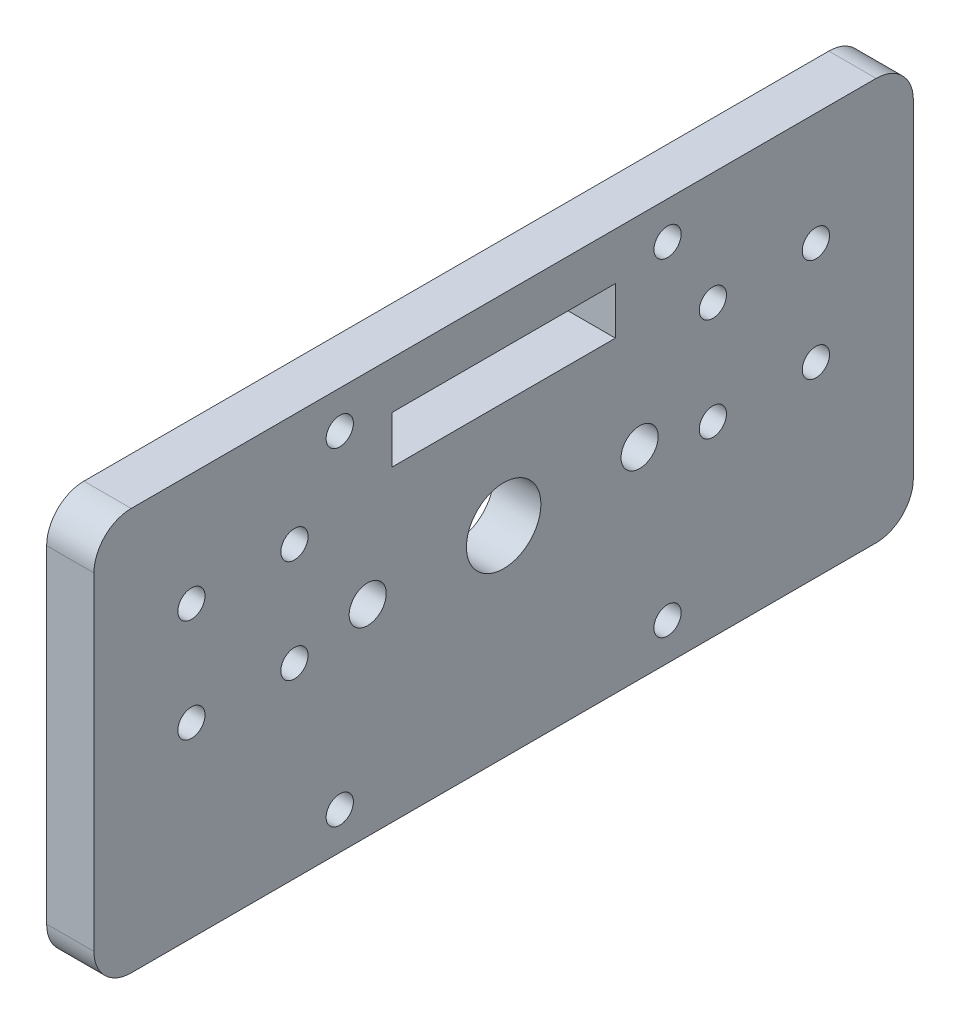
ISO-10303-21;
HEADER;
FILE_DESCRIPTION(('STEP AP214'),'2;1');
FILE_NAME('part.step','',(''),(''),'','','');
FILE_SCHEMA(('AUTOMOTIVE_DESIGN { 1 0 10303 214 1 1 1 1 }'));
ENDSEC;
DATA;
#1=APPLICATION_CONTEXT('core data for automotive mechanical design processes');
#2=APPLICATION_PROTOCOL_DEFINITION('international standard','automotive_design',2000,#1);
#3=PRODUCT_CONTEXT('',#1,'mechanical');
#4=PRODUCT('Part','Part','',(#3));
#5=PRODUCT_RELATED_PRODUCT_CATEGORY('part','',(#4));
#6=PRODUCT_DEFINITION_FORMATION('','',#4);
#7=PRODUCT_DEFINITION_CONTEXT('part definition',#1,'design');
#8=PRODUCT_DEFINITION('design','',#6,#7);
#9=PRODUCT_DEFINITION_SHAPE('','',#8);
#10=(LENGTH_UNIT() NAMED_UNIT(*) SI_UNIT(.MILLI.,.METRE.));
#11=(NAMED_UNIT(*) PLANE_ANGLE_UNIT() SI_UNIT($,.RADIAN.));
#12=(NAMED_UNIT(*) SI_UNIT($,.STERADIAN.) SOLID_ANGLE_UNIT());
#13=UNCERTAINTY_MEASURE_WITH_UNIT(LENGTH_MEASURE(1.E-05),#10,'distance_accuracy_value','');
#14=(GEOMETRIC_REPRESENTATION_CONTEXT(3) GLOBAL_UNCERTAINTY_ASSIGNED_CONTEXT((#13)) GLOBAL_UNIT_ASSIGNED_CONTEXT((#10,
#11,#12)) REPRESENTATION_CONTEXT('',''));
#15=CARTESIAN_POINT('',(0.,0.,0.));
#16=DIRECTION('',(0.,0.,1.));
#17=DIRECTION('',(1.,0.,0.));
#18=AXIS2_PLACEMENT_3D('',#15,#16,#17);
#19=CARTESIAN_POINT('',(6.35,-27.,-55.));
#20=DIRECTION('',(0.,0.,1.));
#21=DIRECTION('',(1.,0.,0.));
#22=AXIS2_PLACEMENT_3D('',#19,#20,#21);
#23=PLANE('',#22);
#24=DIRECTION('',(0.,1.,0.));
#25=VECTOR('',#24,1.);
#26=CARTESIAN_POINT('',(6.35,-27.,-55.));
#27=LINE('',#26,#25);
#28=CARTESIAN_POINT('',(6.35,-22.,-55.));
#29=VERTEX_POINT('',#28);
#30=CARTESIAN_POINT('',(6.35,22.,-55.));
#31=VERTEX_POINT('',#30);
#32=EDGE_CURVE('E239',#29,#31,#27,.T.);
#33=ORIENTED_EDGE('',*,*,#32,.F.);
#34=DIRECTION('',(-1.,0.,0.));
#35=VECTOR('',#34,1.);
#36=CARTESIAN_POINT('',(6.35,-22.,-55.));
#37=LINE('',#36,#35);
#38=CARTESIAN_POINT('',(0.,-22.,-55.));
#39=VERTEX_POINT('',#38);
#40=EDGE_CURVE('E264',#29,#39,#37,.T.);
#41=ORIENTED_EDGE('',*,*,#40,.T.);
#42=DIRECTION('',(0.,1.,0.));
#43=VECTOR('',#42,1.);
#44=CARTESIAN_POINT('',(0.,-27.,-55.));
#45=LINE('',#44,#43);
#46=CARTESIAN_POINT('',(0.,22.,-55.));
#47=VERTEX_POINT('',#46);
#48=EDGE_CURVE('E238',#39,#47,#45,.T.);
#49=ORIENTED_EDGE('',*,*,#48,.T.);
#50=DIRECTION('',(-1.,0.,0.));
#51=VECTOR('',#50,1.);
#52=CARTESIAN_POINT('',(6.35,22.,-55.));
#53=LINE('',#52,#51);
#54=EDGE_CURVE('E252',#47,#31,#53,.F.);
#55=ORIENTED_EDGE('',*,*,#54,.T.);
#56=EDGE_LOOP('',(#33,#41,#49,#55));
#57=FACE_BOUND('',#56,.T.);
#58=ADVANCED_FACE('F32',(#57),#23,.F.);
#59=CARTESIAN_POINT('',(6.35,27.,55.));
#60=DIRECTION('',(0.,-1.,0.));
#61=DIRECTION('',(0.,0.,-1.));
#62=AXIS2_PLACEMENT_3D('',#59,#60,#61);
#63=PLANE('',#62);
#64=DIRECTION('',(0.,0.,1.));
#65=VECTOR('',#64,1.);
#66=CARTESIAN_POINT('',(6.35,27.,55.));
#67=LINE('',#66,#65);
#68=CARTESIAN_POINT('',(6.35,27.,-50.));
#69=VERTEX_POINT('',#68);
#70=CARTESIAN_POINT('',(6.35,27.,50.));
#71=VERTEX_POINT('',#70);
#72=EDGE_CURVE('E242',#69,#71,#67,.T.);
#73=ORIENTED_EDGE('',*,*,#72,.F.);
#74=DIRECTION('',(-1.,0.,0.));
#75=VECTOR('',#74,1.);
#76=CARTESIAN_POINT('',(6.35,27.,-50.));
#77=LINE('',#76,#75);
#78=CARTESIAN_POINT('',(0.,27.,-50.));
#79=VERTEX_POINT('',#78);
#80=EDGE_CURVE('E11',#69,#79,#77,.T.);
#81=ORIENTED_EDGE('',*,*,#80,.T.);
#82=DIRECTION('',(0.,0.,1.));
#83=VECTOR('',#82,1.);
#84=CARTESIAN_POINT('',(0.,27.,55.));
#85=LINE('',#84,#83);
#86=CARTESIAN_POINT('',(0.,27.,50.));
#87=VERTEX_POINT('',#86);
#88=EDGE_CURVE('E255',#79,#87,#85,.T.);
#89=ORIENTED_EDGE('',*,*,#88,.T.);
#90=DIRECTION('',(-1.,0.,0.));
#91=VECTOR('',#90,1.);
#92=CARTESIAN_POINT('',(6.35,27.,50.));
#93=LINE('',#92,#91);
#94=EDGE_CURVE('E40',#87,#71,#93,.F.);
#95=ORIENTED_EDGE('',*,*,#94,.T.);
#96=EDGE_LOOP('',(#73,#81,#89,#95));
#97=FACE_BOUND('',#96,.T.);
#98=ADVANCED_FACE('F295',(#97),#63,.F.);
#99=CARTESIAN_POINT('',(6.35,-27.,55.));
#100=DIRECTION('',(0.,0.,-1.));
#101=DIRECTION('',(-1.,0.,0.));
#102=AXIS2_PLACEMENT_3D('',#99,#100,#101);
#103=PLANE('',#102);
#104=DIRECTION('',(0.,-1.,0.));
#105=VECTOR('',#104,1.);
#106=CARTESIAN_POINT('',(0.,-27.,55.));
#107=LINE('',#106,#105);
#108=CARTESIAN_POINT('',(0.,22.,55.));
#109=VERTEX_POINT('',#108);
#110=CARTESIAN_POINT('',(0.,-22.,55.));
#111=VERTEX_POINT('',#110);
#112=EDGE_CURVE('E258',#109,#111,#107,.T.);
#113=ORIENTED_EDGE('',*,*,#112,.T.);
#114=DIRECTION('',(-1.,0.,0.));
#115=VECTOR('',#114,1.);
#116=CARTESIAN_POINT('',(6.35,-22.,55.));
#117=LINE('',#116,#115);
#118=CARTESIAN_POINT('',(6.35,-22.,55.));
#119=VERTEX_POINT('',#118);
#120=EDGE_CURVE('E291',#111,#119,#117,.F.);
#121=ORIENTED_EDGE('',*,*,#120,.T.);
#122=DIRECTION('',(0.,-1.,0.));
#123=VECTOR('',#122,1.);
#124=CARTESIAN_POINT('',(6.35,-27.,55.));
#125=LINE('',#124,#123);
#126=CARTESIAN_POINT('',(6.35,22.,55.));
#127=VERTEX_POINT('',#126);
#128=EDGE_CURVE('E246',#127,#119,#125,.T.);
#129=ORIENTED_EDGE('',*,*,#128,.F.);
#130=DIRECTION('',(-1.,0.,0.));
#131=VECTOR('',#130,1.);
#132=CARTESIAN_POINT('',(6.35,22.,55.));
#133=LINE('',#132,#131);
#134=EDGE_CURVE('E288',#127,#109,#133,.T.);
#135=ORIENTED_EDGE('',*,*,#134,.T.);
#136=EDGE_LOOP('',(#113,#121,#129,#135));
#137=FACE_BOUND('',#136,.T.);
#138=ADVANCED_FACE('F306',(#137),#103,.F.);
#139=CARTESIAN_POINT('',(6.35,-27.,55.));
#140=DIRECTION('',(0.,1.,0.));
#141=DIRECTION('',(0.,0.,1.));
#142=AXIS2_PLACEMENT_3D('',#139,#140,#141);
#143=PLANE('',#142);
#144=DIRECTION('',(0.,0.,-1.));
#145=VECTOR('',#144,1.);
#146=CARTESIAN_POINT('',(0.,-27.,55.));
#147=LINE('',#146,#145);
#148=CARTESIAN_POINT('',(0.,-27.,50.));
#149=VERTEX_POINT('',#148);
#150=CARTESIAN_POINT('',(0.,-27.,-50.));
#151=VERTEX_POINT('',#150);
#152=EDGE_CURVE('E243',#149,#151,#147,.T.);
#153=ORIENTED_EDGE('',*,*,#152,.T.);
#154=DIRECTION('',(-1.,0.,0.));
#155=VECTOR('',#154,1.);
#156=CARTESIAN_POINT('',(6.35,-27.,-50.));
#157=LINE('',#156,#155);
#158=CARTESIAN_POINT('',(6.35,-27.,-50.));
#159=VERTEX_POINT('',#158);
#160=EDGE_CURVE('E278',#151,#159,#157,.F.);
#161=ORIENTED_EDGE('',*,*,#160,.T.);
#162=DIRECTION('',(0.,0.,-1.));
#163=VECTOR('',#162,1.);
#164=CARTESIAN_POINT('',(6.35,-27.,55.));
#165=LINE('',#164,#163);
#166=CARTESIAN_POINT('',(6.35,-27.,50.));
#167=VERTEX_POINT('',#166);
#168=EDGE_CURVE('E249',#167,#159,#165,.T.);
#169=ORIENTED_EDGE('',*,*,#168,.F.);
#170=DIRECTION('',(-1.,0.,0.));
#171=VECTOR('',#170,1.);
#172=CARTESIAN_POINT('',(6.35,-27.,50.));
#173=LINE('',#172,#171);
#174=EDGE_CURVE('E275',#167,#149,#173,.T.);
#175=ORIENTED_EDGE('',*,*,#174,.T.);
#176=EDGE_LOOP('',(#153,#161,#169,#175));
#177=FACE_BOUND('',#176,.T.);
#178=ADVANCED_FACE('F318',(#177),#143,.F.);
#179=CARTESIAN_POINT('',(6.35,0.,0.));
#180=DIRECTION('',(-1.,0.,0.));
#181=DIRECTION('',(0.,0.,1.));
#182=AXIS2_PLACEMENT_3D('',#179,#180,#181);
#183=PLANE('',#182);
#184=CARTESIAN_POINT('',(6.35,0.,18.25));
#185=DIRECTION('',(-1.,0.,0.));
#186=DIRECTION('',(0.,0.,1.));
#187=AXIS2_PLACEMENT_3D('',#184,#185,#186);
#188=CIRCLE('',#187,2.4892);
#189=CARTESIAN_POINT('',(6.35,0.,20.7392));
#190=VERTEX_POINT('',#189);
#191=EDGE_CURVE('E654',#190,#190,#188,.T.);
#192=ORIENTED_EDGE('',*,*,#191,.T.);
#193=EDGE_LOOP('',(#192));
#194=FACE_BOUND('',#193,.T.);
#195=CARTESIAN_POINT('',(6.35,0.,-18.25));
#196=DIRECTION('',(-1.,0.,0.));
#197=DIRECTION('',(0.,0.,1.));
#198=AXIS2_PLACEMENT_3D('',#195,#196,#197);
#199=CIRCLE('',#198,2.4892);
#200=CARTESIAN_POINT('',(6.35,0.,-15.7608));
#201=VERTEX_POINT('',#200);
#202=EDGE_CURVE('E145',#201,#201,#199,.T.);
#203=ORIENTED_EDGE('',*,*,#202,.T.);
#204=EDGE_LOOP('',(#203));
#205=FACE_BOUND('',#204,.T.);
#206=DIRECTION('',(0.,-1.,0.));
#207=VECTOR('',#206,1.);
#208=CARTESIAN_POINT('',(6.35,14.3,-15.));
#209=LINE('',#208,#207);
#210=CARTESIAN_POINT('',(6.35,20.65,-15.));
#211=VERTEX_POINT('',#210);
#212=CARTESIAN_POINT('',(6.35,14.3,-15.));
#213=VERTEX_POINT('',#212);
#214=EDGE_CURVE('E129',#211,#213,#209,.T.);
#215=ORIENTED_EDGE('',*,*,#214,.T.);
#216=DIRECTION('',(0.,0.,1.));
#217=VECTOR('',#216,1.);
#218=CARTESIAN_POINT('',(6.35,14.3,15.));
#219=LINE('',#218,#217);
#220=CARTESIAN_POINT('',(6.35,14.3,15.));
#221=VERTEX_POINT('',#220);
#222=EDGE_CURVE('E123',#213,#221,#219,.T.);
#223=ORIENTED_EDGE('',*,*,#222,.T.);
#224=DIRECTION('',(0.,1.,0.));
#225=VECTOR('',#224,1.);
#226=CARTESIAN_POINT('',(6.35,14.3,15.));
#227=LINE('',#226,#225);
#228=CARTESIAN_POINT('',(6.35,20.65,15.));
#229=VERTEX_POINT('',#228);
#230=EDGE_CURVE('E132',#221,#229,#227,.T.);
#231=ORIENTED_EDGE('',*,*,#230,.T.);
#232=DIRECTION('',(0.,0.,-1.));
#233=VECTOR('',#232,1.);
#234=CARTESIAN_POINT('',(6.35,20.65,15.));
#235=LINE('',#234,#233);
#236=EDGE_CURVE('E47',#229,#211,#235,.T.);
#237=ORIENTED_EDGE('',*,*,#236,.T.);
#238=EDGE_LOOP('',(#215,#223,#231,#237));
#239=FACE_BOUND('',#238,.T.);
#240=CARTESIAN_POINT('',(6.35,11.8847972132232,41.9147972132232));
#241=DIRECTION('',(1.,0.,0.));
#242=DIRECTION('',(0.,0.,-1.));
#243=AXIS2_PLACEMENT_3D('',#240,#241,#242);
#244=CIRCLE('',#243,1.82879999999999);
#245=CARTESIAN_POINT('',(6.35,11.8847972132232,40.0859972132233));
#246=VERTEX_POINT('',#245);
#247=EDGE_CURVE('E157',#246,#246,#244,.T.);
#248=ORIENTED_EDGE('',*,*,#247,.F.);
#249=EDGE_LOOP('',(#248));
#250=FACE_BOUND('',#249,.T.);
#251=CARTESIAN_POINT('',(6.35,11.8847972132232,28.0852027867768));
#252=DIRECTION('',(1.,0.,0.));
#253=DIRECTION('',(0.,0.,-1.));
#254=AXIS2_PLACEMENT_3D('',#251,#252,#253);
#255=CIRCLE('',#254,1.82879999999999);
#256=CARTESIAN_POINT('',(6.35,11.8847972132232,26.2564027867768));
#257=VERTEX_POINT('',#256);
#258=EDGE_CURVE('E166',#257,#257,#255,.T.);
#259=ORIENTED_EDGE('',*,*,#258,.F.);
#260=EDGE_LOOP('',(#259));
#261=FACE_BOUND('',#260,.T.);
#262=CARTESIAN_POINT('',(6.35,-1.94479721322325,28.0852027867768));
#263=DIRECTION('',(1.,0.,0.));
#264=DIRECTION('',(0.,0.,-1.));
#265=AXIS2_PLACEMENT_3D('',#262,#263,#264);
#266=CIRCLE('',#265,1.82879999999999);
#267=CARTESIAN_POINT('',(6.35,-1.94479721322325,26.2564027867768));
#268=VERTEX_POINT('',#267);
#269=EDGE_CURVE('E172',#268,#268,#266,.T.);
#270=ORIENTED_EDGE('',*,*,#269,.F.);
#271=EDGE_LOOP('',(#270));
#272=FACE_BOUND('',#271,.T.);
#273=CARTESIAN_POINT('',(6.35,-1.94479721322325,41.9147972132232));
#274=DIRECTION('',(1.,0.,0.));
#275=DIRECTION('',(0.,0.,-1.));
#276=AXIS2_PLACEMENT_3D('',#273,#274,#275);
#277=CIRCLE('',#276,1.82879999999999);
#278=CARTESIAN_POINT('',(6.35,-1.94479721322325,40.0859972132233));
#279=VERTEX_POINT('',#278);
#280=EDGE_CURVE('E178',#279,#279,#277,.T.);
#281=ORIENTED_EDGE('',*,*,#280,.F.);
#282=EDGE_LOOP('',(#281));
#283=FACE_BOUND('',#282,.T.);
#284=CARTESIAN_POINT('',(6.35,11.8847972132232,-28.0852027867768));
#285=DIRECTION('',(1.,0.,0.));
#286=DIRECTION('',(0.,0.,-1.));
#287=AXIS2_PLACEMENT_3D('',#284,#285,#286);
#288=CIRCLE('',#287,1.82879999999999);
#289=CARTESIAN_POINT('',(6.35,11.8847972132232,-29.9140027867767));
#290=VERTEX_POINT('',#289);
#291=EDGE_CURVE('E184',#290,#290,#288,.T.);
#292=ORIENTED_EDGE('',*,*,#291,.F.);
#293=EDGE_LOOP('',(#292));
#294=FACE_BOUND('',#293,.T.);
#295=CARTESIAN_POINT('',(6.35,-1.94479721322325,-28.0852027867768));
#296=DIRECTION('',(1.,0.,0.));
#297=DIRECTION('',(0.,0.,-1.));
#298=AXIS2_PLACEMENT_3D('',#295,#296,#297);
#299=CIRCLE('',#298,1.82879999999999);
#300=CARTESIAN_POINT('',(6.35,-1.94479721322325,-29.9140027867767));
#301=VERTEX_POINT('',#300);
#302=EDGE_CURVE('E190',#301,#301,#299,.T.);
#303=ORIENTED_EDGE('',*,*,#302,.F.);
#304=EDGE_LOOP('',(#303));
#305=FACE_BOUND('',#304,.T.);
#306=CARTESIAN_POINT('',(6.35,-1.94479721322325,-41.9147972132233));
#307=DIRECTION('',(1.,0.,0.));
#308=DIRECTION('',(0.,0.,-1.));
#309=AXIS2_PLACEMENT_3D('',#306,#307,#308);
#310=CIRCLE('',#309,1.82879999999999);
#311=CARTESIAN_POINT('',(6.35,-1.94479721322325,-43.7435972132232));
#312=VERTEX_POINT('',#311);
#313=EDGE_CURVE('E196',#312,#312,#310,.T.);
#314=ORIENTED_EDGE('',*,*,#313,.F.);
#315=EDGE_LOOP('',(#314));
#316=FACE_BOUND('',#315,.T.);
#317=CARTESIAN_POINT('',(6.35,11.8847972132233,-41.9147972132233));
#318=DIRECTION('',(1.,0.,0.));
#319=DIRECTION('',(0.,0.,-1.));
#320=AXIS2_PLACEMENT_3D('',#317,#318,#319);
#321=CIRCLE('',#320,1.82879999999999);
#322=CARTESIAN_POINT('',(6.35,11.8847972132233,-43.7435972132232));
#323=VERTEX_POINT('',#322);
#324=EDGE_CURVE('E202',#323,#323,#321,.T.);
#325=ORIENTED_EDGE('',*,*,#324,.F.);
#326=EDGE_LOOP('',(#325));
#327=FACE_BOUND('',#326,.T.);
#328=CARTESIAN_POINT('',(6.35,0.,0.));
#329=DIRECTION('',(1.,0.,0.));
#330=DIRECTION('',(0.,0.,-1.));
#331=AXIS2_PLACEMENT_3D('',#328,#329,#330);
#332=CIRCLE('',#331,5.);
#333=CARTESIAN_POINT('',(6.35,0.,-5.));
#334=VERTEX_POINT('',#333);
#335=EDGE_CURVE('E208',#334,#334,#332,.T.);
#336=ORIENTED_EDGE('',*,*,#335,.F.);
#337=EDGE_LOOP('',(#336));
#338=FACE_BOUND('',#337,.T.);
#339=CARTESIAN_POINT('',(6.35,22.,22.));
#340=DIRECTION('',(1.,0.,0.));
#341=DIRECTION('',(0.,0.,-1.));
#342=AXIS2_PLACEMENT_3D('',#339,#340,#341);
#343=CIRCLE('',#342,1.82879999999999);
#344=CARTESIAN_POINT('',(6.35,22.,20.1712));
#345=VERTEX_POINT('',#344);
#346=EDGE_CURVE('E212',#345,#345,#343,.T.);
#347=ORIENTED_EDGE('',*,*,#346,.F.);
#348=EDGE_LOOP('',(#347));
#349=FACE_BOUND('',#348,.T.);
#350=CARTESIAN_POINT('',(6.35,22.,-22.));
#351=DIRECTION('',(1.,0.,0.));
#352=DIRECTION('',(0.,0.,-1.));
#353=AXIS2_PLACEMENT_3D('',#350,#351,#352);
#354=CIRCLE('',#353,1.82879999999999);
#355=CARTESIAN_POINT('',(6.35,22.,-23.8288));
#356=VERTEX_POINT('',#355);
#357=EDGE_CURVE('E220',#356,#356,#354,.T.);
#358=ORIENTED_EDGE('',*,*,#357,.F.);
#359=EDGE_LOOP('',(#358));
#360=FACE_BOUND('',#359,.T.);
#361=CARTESIAN_POINT('',(6.35,-22.,-22.));
#362=DIRECTION('',(1.,0.,0.));
#363=DIRECTION('',(0.,0.,-1.));
#364=AXIS2_PLACEMENT_3D('',#361,#362,#363);
#365=CIRCLE('',#364,1.82879999999999);
#366=CARTESIAN_POINT('',(6.35,-22.,-23.8288));
#367=VERTEX_POINT('',#366);
#368=EDGE_CURVE('E226',#367,#367,#365,.T.);
#369=ORIENTED_EDGE('',*,*,#368,.F.);
#370=EDGE_LOOP('',(#369));
#371=FACE_BOUND('',#370,.T.);
#372=CARTESIAN_POINT('',(6.35,-22.,22.));
#373=DIRECTION('',(1.,0.,0.));
#374=DIRECTION('',(0.,0.,-1.));
#375=AXIS2_PLACEMENT_3D('',#372,#373,#374);
#376=CIRCLE('',#375,1.82879999999999);
#377=CARTESIAN_POINT('',(6.35,-22.,20.1712));
#378=VERTEX_POINT('',#377);
#379=EDGE_CURVE('E232',#378,#378,#376,.T.);
#380=ORIENTED_EDGE('',*,*,#379,.F.);
#381=EDGE_LOOP('',(#380));
#382=FACE_BOUND('',#381,.T.);
#383=ORIENTED_EDGE('',*,*,#168,.T.);
#384=CARTESIAN_POINT('',(6.35,-22.,-50.));
#385=DIRECTION('',(-1.,0.,0.));
#386=DIRECTION('',(0.,0.,1.));
#387=AXIS2_PLACEMENT_3D('',#384,#385,#386);
#388=CIRCLE('',#387,5.);
#389=EDGE_CURVE('E286',#159,#29,#388,.F.);
#390=ORIENTED_EDGE('',*,*,#389,.T.);
#391=ORIENTED_EDGE('',*,*,#32,.T.);
#392=CARTESIAN_POINT('',(6.35,22.,-50.));
#393=DIRECTION('',(-1.,0.,0.));
#394=DIRECTION('',(0.,0.,1.));
#395=AXIS2_PLACEMENT_3D('',#392,#393,#394);
#396=CIRCLE('',#395,5.);
#397=EDGE_CURVE('E282',#31,#69,#396,.F.);
#398=ORIENTED_EDGE('',*,*,#397,.T.);
#399=ORIENTED_EDGE('',*,*,#72,.T.);
#400=CARTESIAN_POINT('',(6.35,22.,50.));
#401=DIRECTION('',(-1.,0.,0.));
#402=DIRECTION('',(0.,0.,1.));
#403=AXIS2_PLACEMENT_3D('',#400,#401,#402);
#404=CIRCLE('',#403,5.);
#405=EDGE_CURVE('E280',#71,#127,#404,.F.);
#406=ORIENTED_EDGE('',*,*,#405,.T.);
#407=ORIENTED_EDGE('',*,*,#128,.T.);
#408=CARTESIAN_POINT('',(6.35,-22.,50.));
#409=DIRECTION('',(-1.,0.,0.));
#410=DIRECTION('',(0.,0.,1.));
#411=AXIS2_PLACEMENT_3D('',#408,#409,#410);
#412=CIRCLE('',#411,5.);
#413=EDGE_CURVE('E284',#119,#167,#412,.F.);
#414=ORIENTED_EDGE('',*,*,#413,.T.);
#415=EDGE_LOOP('',(#383,#390,#391,#398,#399,#406,#407,#414));
#416=FACE_BOUND('',#415,.T.);
#417=ADVANCED_FACE('F136',(#194,#205,#239,#250,#261,#272,#283,#294,#305,#316,#327,#338,#349,
#360,#371,#382,#416),#183,.F.);
#418=CARTESIAN_POINT('',(0.,0.,0.));
#419=DIRECTION('',(-1.,0.,0.));
#420=DIRECTION('',(0.,0.,1.));
#421=AXIS2_PLACEMENT_3D('',#418,#419,#420);
#422=PLANE('',#421);
#423=CARTESIAN_POINT('',(0.,0.,18.25));
#424=DIRECTION('',(-1.,0.,0.));
#425=DIRECTION('',(0.,0.,1.));
#426=AXIS2_PLACEMENT_3D('',#423,#424,#425);
#427=CIRCLE('',#426,2.4892);
#428=CARTESIAN_POINT('',(0.,0.,20.7392));
#429=VERTEX_POINT('',#428);
#430=EDGE_CURVE('E656',#429,#429,#427,.T.);
#431=ORIENTED_EDGE('',*,*,#430,.F.);
#432=EDGE_LOOP('',(#431));
#433=FACE_BOUND('',#432,.T.);
#434=CARTESIAN_POINT('',(0.,0.,-18.25));
#435=DIRECTION('',(-1.,0.,0.));
#436=DIRECTION('',(0.,0.,1.));
#437=AXIS2_PLACEMENT_3D('',#434,#435,#436);
#438=CIRCLE('',#437,2.4892);
#439=CARTESIAN_POINT('',(0.,0.,-15.7608));
#440=VERTEX_POINT('',#439);
#441=EDGE_CURVE('E658',#440,#440,#438,.T.);
#442=ORIENTED_EDGE('',*,*,#441,.F.);
#443=EDGE_LOOP('',(#442));
#444=FACE_BOUND('',#443,.T.);
#445=DIRECTION('',(0.,0.,1.));
#446=VECTOR('',#445,1.);
#447=CARTESIAN_POINT('',(0.,14.3,15.));
#448=LINE('',#447,#446);
#449=CARTESIAN_POINT('',(0.,14.3,-15.));
#450=VERTEX_POINT('',#449);
#451=CARTESIAN_POINT('',(0.,14.3,15.));
#452=VERTEX_POINT('',#451);
#453=EDGE_CURVE('E55',#450,#452,#448,.T.);
#454=ORIENTED_EDGE('',*,*,#453,.F.);
#455=DIRECTION('',(0.,-1.,0.));
#456=VECTOR('',#455,1.);
#457=CARTESIAN_POINT('',(0.,14.3,-15.));
#458=LINE('',#457,#456);
#459=CARTESIAN_POINT('',(0.,20.65,-15.));
#460=VERTEX_POINT('',#459);
#461=EDGE_CURVE('E139',#460,#450,#458,.T.);
#462=ORIENTED_EDGE('',*,*,#461,.F.);
#463=DIRECTION('',(0.,0.,-1.));
#464=VECTOR('',#463,1.);
#465=CARTESIAN_POINT('',(0.,20.65,15.));
#466=LINE('',#465,#464);
#467=CARTESIAN_POINT('',(0.,20.65,15.));
#468=VERTEX_POINT('',#467);
#469=EDGE_CURVE('E142',#468,#460,#466,.T.);
#470=ORIENTED_EDGE('',*,*,#469,.F.);
#471=DIRECTION('',(0.,1.,0.));
#472=VECTOR('',#471,1.);
#473=CARTESIAN_POINT('',(0.,14.3,15.));
#474=LINE('',#473,#472);
#475=EDGE_CURVE('E151',#452,#468,#474,.T.);
#476=ORIENTED_EDGE('',*,*,#475,.F.);
#477=EDGE_LOOP('',(#454,#462,#470,#476));
#478=FACE_BOUND('',#477,.T.);
#479=CARTESIAN_POINT('',(0.,11.8847972132232,41.9147972132232));
#480=DIRECTION('',(1.,0.,0.));
#481=DIRECTION('',(0.,0.,-1.));
#482=AXIS2_PLACEMENT_3D('',#479,#480,#481);
#483=CIRCLE('',#482,1.82879999999999);
#484=CARTESIAN_POINT('',(0.,11.8847972132232,40.0859972132233));
#485=VERTEX_POINT('',#484);
#486=EDGE_CURVE('E163',#485,#485,#483,.T.);
#487=ORIENTED_EDGE('',*,*,#486,.T.);
#488=EDGE_LOOP('',(#487));
#489=FACE_BOUND('',#488,.T.);
#490=CARTESIAN_POINT('',(0.,11.8847972132232,28.0852027867768));
#491=DIRECTION('',(1.,0.,0.));
#492=DIRECTION('',(0.,0.,-1.));
#493=AXIS2_PLACEMENT_3D('',#490,#491,#492);
#494=CIRCLE('',#493,1.82879999999999);
#495=CARTESIAN_POINT('',(0.,11.8847972132232,26.2564027867768));
#496=VERTEX_POINT('',#495);
#497=EDGE_CURVE('E169',#496,#496,#494,.T.);
#498=ORIENTED_EDGE('',*,*,#497,.T.);
#499=EDGE_LOOP('',(#498));
#500=FACE_BOUND('',#499,.T.);
#501=CARTESIAN_POINT('',(0.,-1.94479721322325,28.0852027867768));
#502=DIRECTION('',(1.,0.,0.));
#503=DIRECTION('',(0.,0.,-1.));
#504=AXIS2_PLACEMENT_3D('',#501,#502,#503);
#505=CIRCLE('',#504,1.82879999999999);
#506=CARTESIAN_POINT('',(0.,-1.94479721322325,26.2564027867768));
#507=VERTEX_POINT('',#506);
#508=EDGE_CURVE('E175',#507,#507,#505,.T.);
#509=ORIENTED_EDGE('',*,*,#508,.T.);
#510=EDGE_LOOP('',(#509));
#511=FACE_BOUND('',#510,.T.);
#512=CARTESIAN_POINT('',(0.,-1.94479721322325,41.9147972132232));
#513=DIRECTION('',(1.,0.,0.));
#514=DIRECTION('',(0.,0.,-1.));
#515=AXIS2_PLACEMENT_3D('',#512,#513,#514);
#516=CIRCLE('',#515,1.82879999999999);
#517=CARTESIAN_POINT('',(0.,-1.94479721322325,40.0859972132233));
#518=VERTEX_POINT('',#517);
#519=EDGE_CURVE('E181',#518,#518,#516,.T.);
#520=ORIENTED_EDGE('',*,*,#519,.T.);
#521=EDGE_LOOP('',(#520));
#522=FACE_BOUND('',#521,.T.);
#523=CARTESIAN_POINT('',(0.,11.8847972132232,-28.0852027867768));
#524=DIRECTION('',(1.,0.,0.));
#525=DIRECTION('',(0.,0.,-1.));
#526=AXIS2_PLACEMENT_3D('',#523,#524,#525);
#527=CIRCLE('',#526,1.82879999999999);
#528=CARTESIAN_POINT('',(0.,11.8847972132232,-29.9140027867767));
#529=VERTEX_POINT('',#528);
#530=EDGE_CURVE('E187',#529,#529,#527,.T.);
#531=ORIENTED_EDGE('',*,*,#530,.T.);
#532=EDGE_LOOP('',(#531));
#533=FACE_BOUND('',#532,.T.);
#534=CARTESIAN_POINT('',(0.,-1.94479721322325,-28.0852027867768));
#535=DIRECTION('',(1.,0.,0.));
#536=DIRECTION('',(0.,0.,-1.));
#537=AXIS2_PLACEMENT_3D('',#534,#535,#536);
#538=CIRCLE('',#537,1.82879999999999);
#539=CARTESIAN_POINT('',(0.,-1.94479721322325,-29.9140027867767));
#540=VERTEX_POINT('',#539);
#541=EDGE_CURVE('E193',#540,#540,#538,.T.);
#542=ORIENTED_EDGE('',*,*,#541,.T.);
#543=EDGE_LOOP('',(#542));
#544=FACE_BOUND('',#543,.T.);
#545=CARTESIAN_POINT('',(0.,-1.94479721322325,-41.9147972132233));
#546=DIRECTION('',(1.,0.,0.));
#547=DIRECTION('',(0.,0.,-1.));
#548=AXIS2_PLACEMENT_3D('',#545,#546,#547);
#549=CIRCLE('',#548,1.82879999999999);
#550=CARTESIAN_POINT('',(0.,-1.94479721322325,-43.7435972132232));
#551=VERTEX_POINT('',#550);
#552=EDGE_CURVE('E199',#551,#551,#549,.T.);
#553=ORIENTED_EDGE('',*,*,#552,.T.);
#554=EDGE_LOOP('',(#553));
#555=FACE_BOUND('',#554,.T.);
#556=CARTESIAN_POINT('',(0.,11.8847972132233,-41.9147972132233));
#557=DIRECTION('',(1.,0.,0.));
#558=DIRECTION('',(0.,0.,-1.));
#559=AXIS2_PLACEMENT_3D('',#556,#557,#558);
#560=CIRCLE('',#559,1.82879999999999);
#561=CARTESIAN_POINT('',(0.,11.8847972132233,-43.7435972132232));
#562=VERTEX_POINT('',#561);
#563=EDGE_CURVE('E205',#562,#562,#560,.T.);
#564=ORIENTED_EDGE('',*,*,#563,.T.);
#565=EDGE_LOOP('',(#564));
#566=FACE_BOUND('',#565,.T.);
#567=CARTESIAN_POINT('',(0.,0.,0.));
#568=DIRECTION('',(1.,0.,0.));
#569=DIRECTION('',(0.,0.,-1.));
#570=AXIS2_PLACEMENT_3D('',#567,#568,#569);
#571=CIRCLE('',#570,5.);
#572=CARTESIAN_POINT('',(0.,0.,-5.));
#573=VERTEX_POINT('',#572);
#574=EDGE_CURVE('E209',#573,#573,#571,.T.);
#575=ORIENTED_EDGE('',*,*,#574,.T.);
#576=EDGE_LOOP('',(#575));
#577=FACE_BOUND('',#576,.T.);
#578=CARTESIAN_POINT('',(0.,22.,22.));
#579=DIRECTION('',(1.,0.,0.));
#580=DIRECTION('',(0.,0.,-1.));
#581=AXIS2_PLACEMENT_3D('',#578,#579,#580);
#582=CIRCLE('',#581,1.82879999999999);
#583=CARTESIAN_POINT('',(0.,22.,20.1712));
#584=VERTEX_POINT('',#583);
#585=EDGE_CURVE('E217',#584,#584,#582,.T.);
#586=ORIENTED_EDGE('',*,*,#585,.T.);
#587=EDGE_LOOP('',(#586));
#588=FACE_BOUND('',#587,.T.);
#589=CARTESIAN_POINT('',(0.,22.,-22.));
#590=DIRECTION('',(1.,0.,0.));
#591=DIRECTION('',(0.,0.,-1.));
#592=AXIS2_PLACEMENT_3D('',#589,#590,#591);
#593=CIRCLE('',#592,1.82879999999999);
#594=CARTESIAN_POINT('',(0.,22.,-23.8288));
#595=VERTEX_POINT('',#594);
#596=EDGE_CURVE('E223',#595,#595,#593,.T.);
#597=ORIENTED_EDGE('',*,*,#596,.T.);
#598=EDGE_LOOP('',(#597));
#599=FACE_BOUND('',#598,.T.);
#600=CARTESIAN_POINT('',(0.,-22.,-22.));
#601=DIRECTION('',(1.,0.,0.));
#602=DIRECTION('',(0.,0.,-1.));
#603=AXIS2_PLACEMENT_3D('',#600,#601,#602);
#604=CIRCLE('',#603,1.82879999999999);
#605=CARTESIAN_POINT('',(0.,-22.,-23.8288));
#606=VERTEX_POINT('',#605);
#607=EDGE_CURVE('E229',#606,#606,#604,.T.);
#608=ORIENTED_EDGE('',*,*,#607,.T.);
#609=EDGE_LOOP('',(#608));
#610=FACE_BOUND('',#609,.T.);
#611=CARTESIAN_POINT('',(0.,-22.,22.));
#612=DIRECTION('',(1.,0.,0.));
#613=DIRECTION('',(0.,0.,-1.));
#614=AXIS2_PLACEMENT_3D('',#611,#612,#613);
#615=CIRCLE('',#614,1.82879999999999);
#616=CARTESIAN_POINT('',(0.,-22.,20.1712));
#617=VERTEX_POINT('',#616);
#618=EDGE_CURVE('E235',#617,#617,#615,.T.);
#619=ORIENTED_EDGE('',*,*,#618,.T.);
#620=EDGE_LOOP('',(#619));
#621=FACE_BOUND('',#620,.T.);
#622=ORIENTED_EDGE('',*,*,#48,.F.);
#623=CARTESIAN_POINT('',(0.,-22.,-50.));
#624=DIRECTION('',(-1.,0.,0.));
#625=DIRECTION('',(0.,0.,1.));
#626=AXIS2_PLACEMENT_3D('',#623,#624,#625);
#627=CIRCLE('',#626,5.);
#628=EDGE_CURVE('E273',#39,#151,#627,.T.);
#629=ORIENTED_EDGE('',*,*,#628,.T.);
#630=ORIENTED_EDGE('',*,*,#152,.F.);
#631=CARTESIAN_POINT('',(0.,-22.,50.));
#632=DIRECTION('',(-1.,0.,0.));
#633=DIRECTION('',(0.,0.,1.));
#634=AXIS2_PLACEMENT_3D('',#631,#632,#633);
#635=CIRCLE('',#634,5.);
#636=EDGE_CURVE('E271',#149,#111,#635,.T.);
#637=ORIENTED_EDGE('',*,*,#636,.T.);
#638=ORIENTED_EDGE('',*,*,#112,.F.);
#639=CARTESIAN_POINT('',(0.,22.,50.));
#640=DIRECTION('',(-1.,0.,0.));
#641=DIRECTION('',(0.,0.,1.));
#642=AXIS2_PLACEMENT_3D('',#639,#640,#641);
#643=CIRCLE('',#642,5.);
#644=EDGE_CURVE('E267',#109,#87,#643,.T.);
#645=ORIENTED_EDGE('',*,*,#644,.T.);
#646=ORIENTED_EDGE('',*,*,#88,.F.);
#647=CARTESIAN_POINT('',(0.,22.,-50.));
#648=DIRECTION('',(-1.,0.,0.));
#649=DIRECTION('',(0.,0.,1.));
#650=AXIS2_PLACEMENT_3D('',#647,#648,#649);
#651=CIRCLE('',#650,5.);
#652=EDGE_CURVE('E269',#79,#47,#651,.T.);
#653=ORIENTED_EDGE('',*,*,#652,.T.);
#654=EDGE_LOOP('',(#622,#629,#630,#637,#638,#645,#646,#653));
#655=FACE_BOUND('',#654,.T.);
#656=ADVANCED_FACE('F310',(#433,#444,#478,#489,#500,#511,#522,#533,#544,#555,#566,#577,#588,
#599,#610,#621,#655),#422,.T.);
#657=CARTESIAN_POINT('',(6.35,-22.,-50.));
#658=DIRECTION('',(-1.,0.,0.));
#659=DIRECTION('',(0.,0.,1.));
#660=AXIS2_PLACEMENT_3D('',#657,#658,#659);
#661=CYLINDRICAL_SURFACE('',#660,5.);
#662=ORIENTED_EDGE('',*,*,#389,.F.);
#663=ORIENTED_EDGE('',*,*,#160,.F.);
#664=ORIENTED_EDGE('',*,*,#628,.F.);
#665=ORIENTED_EDGE('',*,*,#40,.F.);
#666=EDGE_LOOP('',(#662,#663,#664,#665));
#667=FACE_BOUND('',#666,.T.);
#668=ADVANCED_FACE('F324',(#667),#661,.T.);
#669=CARTESIAN_POINT('',(6.35,-22.,50.));
#670=DIRECTION('',(-1.,0.,0.));
#671=DIRECTION('',(0.,0.,1.));
#672=AXIS2_PLACEMENT_3D('',#669,#670,#671);
#673=CYLINDRICAL_SURFACE('',#672,5.);
#674=ORIENTED_EDGE('',*,*,#413,.F.);
#675=ORIENTED_EDGE('',*,*,#120,.F.);
#676=ORIENTED_EDGE('',*,*,#636,.F.);
#677=ORIENTED_EDGE('',*,*,#174,.F.);
#678=EDGE_LOOP('',(#674,#675,#676,#677));
#679=FACE_BOUND('',#678,.T.);
#680=ADVANCED_FACE('F315',(#679),#673,.T.);
#681=CARTESIAN_POINT('',(6.35,22.,-50.));
#682=DIRECTION('',(-1.,0.,0.));
#683=DIRECTION('',(0.,0.,1.));
#684=AXIS2_PLACEMENT_3D('',#681,#682,#683);
#685=CYLINDRICAL_SURFACE('',#684,5.);
#686=ORIENTED_EDGE('',*,*,#397,.F.);
#687=ORIENTED_EDGE('',*,*,#54,.F.);
#688=ORIENTED_EDGE('',*,*,#652,.F.);
#689=ORIENTED_EDGE('',*,*,#80,.F.);
#690=EDGE_LOOP('',(#686,#687,#688,#689));
#691=FACE_BOUND('',#690,.T.);
#692=ADVANCED_FACE('F328',(#691),#685,.T.);
#693=CARTESIAN_POINT('',(6.35,22.,50.));
#694=DIRECTION('',(-1.,0.,0.));
#695=DIRECTION('',(0.,0.,1.));
#696=AXIS2_PLACEMENT_3D('',#693,#694,#695);
#697=CYLINDRICAL_SURFACE('',#696,5.);
#698=ORIENTED_EDGE('',*,*,#405,.F.);
#699=ORIENTED_EDGE('',*,*,#94,.F.);
#700=ORIENTED_EDGE('',*,*,#644,.F.);
#701=ORIENTED_EDGE('',*,*,#134,.F.);
#702=EDGE_LOOP('',(#698,#699,#700,#701));
#703=FACE_BOUND('',#702,.T.);
#704=ADVANCED_FACE('F34',(#703),#697,.T.);
#705=CARTESIAN_POINT('',(6.35,-22.,22.));
#706=DIRECTION('',(1.,0.,0.));
#707=DIRECTION('',(0.,0.,-1.));
#708=AXIS2_PLACEMENT_3D('',#705,#706,#707);
#709=CYLINDRICAL_SURFACE('',#708,1.82879999999999);
#710=ORIENTED_EDGE('',*,*,#618,.F.);
#711=EDGE_LOOP('',(#710));
#712=FACE_BOUND('',#711,.T.);
#713=ORIENTED_EDGE('',*,*,#379,.T.);
#714=EDGE_LOOP('',(#713));
#715=FACE_BOUND('',#714,.T.);
#716=ADVANCED_FACE('F334',(#712,#715),#709,.F.);
#717=CARTESIAN_POINT('',(6.35,-22.,-22.));
#718=DIRECTION('',(1.,0.,0.));
#719=DIRECTION('',(0.,0.,-1.));
#720=AXIS2_PLACEMENT_3D('',#717,#718,#719);
#721=CYLINDRICAL_SURFACE('',#720,1.82879999999999);
#722=ORIENTED_EDGE('',*,*,#607,.F.);
#723=EDGE_LOOP('',(#722));
#724=FACE_BOUND('',#723,.T.);
#725=ORIENTED_EDGE('',*,*,#368,.T.);
#726=EDGE_LOOP('',(#725));
#727=FACE_BOUND('',#726,.T.);
#728=ADVANCED_FACE('F463',(#724,#727),#721,.F.);
#729=CARTESIAN_POINT('',(6.35,22.,-22.));
#730=DIRECTION('',(1.,0.,0.));
#731=DIRECTION('',(0.,0.,-1.));
#732=AXIS2_PLACEMENT_3D('',#729,#730,#731);
#733=CYLINDRICAL_SURFACE('',#732,1.82879999999999);
#734=ORIENTED_EDGE('',*,*,#596,.F.);
#735=EDGE_LOOP('',(#734));
#736=FACE_BOUND('',#735,.T.);
#737=ORIENTED_EDGE('',*,*,#357,.T.);
#738=EDGE_LOOP('',(#737));
#739=FACE_BOUND('',#738,.T.);
#740=ADVANCED_FACE('F459',(#736,#739),#733,.F.);
#741=CARTESIAN_POINT('',(6.35,22.,22.));
#742=DIRECTION('',(1.,0.,0.));
#743=DIRECTION('',(0.,0.,-1.));
#744=AXIS2_PLACEMENT_3D('',#741,#742,#743);
#745=CYLINDRICAL_SURFACE('',#744,1.82879999999999);
#746=ORIENTED_EDGE('',*,*,#585,.F.);
#747=EDGE_LOOP('',(#746));
#748=FACE_BOUND('',#747,.T.);
#749=ORIENTED_EDGE('',*,*,#346,.T.);
#750=EDGE_LOOP('',(#749));
#751=FACE_BOUND('',#750,.T.);
#752=ADVANCED_FACE('F455',(#748,#751),#745,.F.);
#753=CARTESIAN_POINT('',(0.,0.,0.));
#754=DIRECTION('',(1.,0.,0.));
#755=DIRECTION('',(0.,0.,-1.));
#756=AXIS2_PLACEMENT_3D('',#753,#754,#755);
#757=CYLINDRICAL_SURFACE('',#756,5.);
#758=ORIENTED_EDGE('',*,*,#574,.F.);
#759=EDGE_LOOP('',(#758));
#760=FACE_BOUND('',#759,.T.);
#761=ORIENTED_EDGE('',*,*,#335,.T.);
#762=EDGE_LOOP('',(#761));
#763=FACE_BOUND('',#762,.T.);
#764=ADVANCED_FACE('F451',(#760,#763),#757,.F.);
#765=CARTESIAN_POINT('',(6.35,11.8847972132233,-41.9147972132233));
#766=DIRECTION('',(1.,0.,0.));
#767=DIRECTION('',(0.,0.,-1.));
#768=AXIS2_PLACEMENT_3D('',#765,#766,#767);
#769=CYLINDRICAL_SURFACE('',#768,1.82879999999999);
#770=ORIENTED_EDGE('',*,*,#563,.F.);
#771=EDGE_LOOP('',(#770));
#772=FACE_BOUND('',#771,.T.);
#773=ORIENTED_EDGE('',*,*,#324,.T.);
#774=EDGE_LOOP('',(#773));
#775=FACE_BOUND('',#774,.T.);
#776=ADVANCED_FACE('F447',(#772,#775),#769,.F.);
#777=CARTESIAN_POINT('',(6.35,-1.94479721322325,-41.9147972132233));
#778=DIRECTION('',(1.,0.,0.));
#779=DIRECTION('',(0.,0.,-1.));
#780=AXIS2_PLACEMENT_3D('',#777,#778,#779);
#781=CYLINDRICAL_SURFACE('',#780,1.82879999999999);
#782=ORIENTED_EDGE('',*,*,#552,.F.);
#783=EDGE_LOOP('',(#782));
#784=FACE_BOUND('',#783,.T.);
#785=ORIENTED_EDGE('',*,*,#313,.T.);
#786=EDGE_LOOP('',(#785));
#787=FACE_BOUND('',#786,.T.);
#788=ADVANCED_FACE('F443',(#784,#787),#781,.F.);
#789=CARTESIAN_POINT('',(6.35,-1.94479721322325,-28.0852027867768));
#790=DIRECTION('',(1.,0.,0.));
#791=DIRECTION('',(0.,0.,-1.));
#792=AXIS2_PLACEMENT_3D('',#789,#790,#791);
#793=CYLINDRICAL_SURFACE('',#792,1.82879999999999);
#794=ORIENTED_EDGE('',*,*,#541,.F.);
#795=EDGE_LOOP('',(#794));
#796=FACE_BOUND('',#795,.T.);
#797=ORIENTED_EDGE('',*,*,#302,.T.);
#798=EDGE_LOOP('',(#797));
#799=FACE_BOUND('',#798,.T.);
#800=ADVANCED_FACE('F439',(#796,#799),#793,.F.);
#801=CARTESIAN_POINT('',(6.35,11.8847972132232,-28.0852027867768));
#802=DIRECTION('',(1.,0.,0.));
#803=DIRECTION('',(0.,0.,-1.));
#804=AXIS2_PLACEMENT_3D('',#801,#802,#803);
#805=CYLINDRICAL_SURFACE('',#804,1.82879999999999);
#806=ORIENTED_EDGE('',*,*,#530,.F.);
#807=EDGE_LOOP('',(#806));
#808=FACE_BOUND('',#807,.T.);
#809=ORIENTED_EDGE('',*,*,#291,.T.);
#810=EDGE_LOOP('',(#809));
#811=FACE_BOUND('',#810,.T.);
#812=ADVANCED_FACE('F435',(#808,#811),#805,.F.);
#813=CARTESIAN_POINT('',(6.35,-1.94479721322325,41.9147972132232));
#814=DIRECTION('',(1.,0.,0.));
#815=DIRECTION('',(0.,0.,-1.));
#816=AXIS2_PLACEMENT_3D('',#813,#814,#815);
#817=CYLINDRICAL_SURFACE('',#816,1.82879999999999);
#818=ORIENTED_EDGE('',*,*,#519,.F.);
#819=EDGE_LOOP('',(#818));
#820=FACE_BOUND('',#819,.T.);
#821=ORIENTED_EDGE('',*,*,#280,.T.);
#822=EDGE_LOOP('',(#821));
#823=FACE_BOUND('',#822,.T.);
#824=ADVANCED_FACE('F431',(#820,#823),#817,.F.);
#825=CARTESIAN_POINT('',(6.35,-1.94479721322325,28.0852027867768));
#826=DIRECTION('',(1.,0.,0.));
#827=DIRECTION('',(0.,0.,-1.));
#828=AXIS2_PLACEMENT_3D('',#825,#826,#827);
#829=CYLINDRICAL_SURFACE('',#828,1.82879999999999);
#830=ORIENTED_EDGE('',*,*,#508,.F.);
#831=EDGE_LOOP('',(#830));
#832=FACE_BOUND('',#831,.T.);
#833=ORIENTED_EDGE('',*,*,#269,.T.);
#834=EDGE_LOOP('',(#833));
#835=FACE_BOUND('',#834,.T.);
#836=ADVANCED_FACE('F427',(#832,#835),#829,.F.);
#837=CARTESIAN_POINT('',(6.35,11.8847972132232,28.0852027867768));
#838=DIRECTION('',(1.,0.,0.));
#839=DIRECTION('',(0.,0.,-1.));
#840=AXIS2_PLACEMENT_3D('',#837,#838,#839);
#841=CYLINDRICAL_SURFACE('',#840,1.82879999999999);
#842=ORIENTED_EDGE('',*,*,#497,.F.);
#843=EDGE_LOOP('',(#842));
#844=FACE_BOUND('',#843,.T.);
#845=ORIENTED_EDGE('',*,*,#258,.T.);
#846=EDGE_LOOP('',(#845));
#847=FACE_BOUND('',#846,.T.);
#848=ADVANCED_FACE('F423',(#844,#847),#841,.F.);
#849=CARTESIAN_POINT('',(6.35,11.8847972132232,41.9147972132232));
#850=DIRECTION('',(1.,0.,0.));
#851=DIRECTION('',(0.,0.,-1.));
#852=AXIS2_PLACEMENT_3D('',#849,#850,#851);
#853=CYLINDRICAL_SURFACE('',#852,1.82879999999999);
#854=ORIENTED_EDGE('',*,*,#486,.F.);
#855=EDGE_LOOP('',(#854));
#856=FACE_BOUND('',#855,.T.);
#857=ORIENTED_EDGE('',*,*,#247,.T.);
#858=EDGE_LOOP('',(#857));
#859=FACE_BOUND('',#858,.T.);
#860=ADVANCED_FACE('F420',(#856,#859),#853,.F.);
#861=CARTESIAN_POINT('',(6.35,14.3,15.));
#862=DIRECTION('',(0.,-1.,0.));
#863=DIRECTION('',(0.,0.,-1.));
#864=AXIS2_PLACEMENT_3D('',#861,#862,#863);
#865=PLANE('',#864);
#866=ORIENTED_EDGE('',*,*,#453,.T.);
#867=DIRECTION('',(-1.,0.,0.));
#868=VECTOR('',#867,1.);
#869=CARTESIAN_POINT('',(6.35,14.3,15.));
#870=LINE('',#869,#868);
#871=EDGE_CURVE('E119',#221,#452,#870,.T.);
#872=ORIENTED_EDGE('',*,*,#871,.F.);
#873=ORIENTED_EDGE('',*,*,#222,.F.);
#874=DIRECTION('',(-1.,0.,0.));
#875=VECTOR('',#874,1.);
#876=CARTESIAN_POINT('',(6.35,14.3,-15.));
#877=LINE('',#876,#875);
#878=EDGE_CURVE('E155',#213,#450,#877,.T.);
#879=ORIENTED_EDGE('',*,*,#878,.T.);
#880=EDGE_LOOP('',(#866,#872,#873,#879));
#881=FACE_BOUND('',#880,.T.);
#882=ADVANCED_FACE('F121',(#881),#865,.F.);
#883=CARTESIAN_POINT('',(6.35,14.3,-15.));
#884=DIRECTION('',(0.,0.,-1.));
#885=DIRECTION('',(-1.,0.,0.));
#886=AXIS2_PLACEMENT_3D('',#883,#884,#885);
#887=PLANE('',#886);
#888=ORIENTED_EDGE('',*,*,#461,.T.);
#889=ORIENTED_EDGE('',*,*,#878,.F.);
#890=ORIENTED_EDGE('',*,*,#214,.F.);
#891=DIRECTION('',(-1.,0.,0.));
#892=VECTOR('',#891,1.);
#893=CARTESIAN_POINT('',(6.35,20.65,-15.));
#894=LINE('',#893,#892);
#895=EDGE_CURVE('E158',#211,#460,#894,.T.);
#896=ORIENTED_EDGE('',*,*,#895,.T.);
#897=EDGE_LOOP('',(#888,#889,#890,#896));
#898=FACE_BOUND('',#897,.T.);
#899=ADVANCED_FACE('F410',(#898),#887,.F.);
#900=CARTESIAN_POINT('',(6.35,20.65,15.));
#901=DIRECTION('',(0.,1.,0.));
#902=DIRECTION('',(0.,0.,1.));
#903=AXIS2_PLACEMENT_3D('',#900,#901,#902);
#904=PLANE('',#903);
#905=ORIENTED_EDGE('',*,*,#469,.T.);
#906=ORIENTED_EDGE('',*,*,#895,.F.);
#907=ORIENTED_EDGE('',*,*,#236,.F.);
#908=DIRECTION('',(-1.,0.,0.));
#909=VECTOR('',#908,1.);
#910=CARTESIAN_POINT('',(6.35,20.65,15.));
#911=LINE('',#910,#909);
#912=EDGE_CURVE('E128',#229,#468,#911,.T.);
#913=ORIENTED_EDGE('',*,*,#912,.T.);
#914=EDGE_LOOP('',(#905,#906,#907,#913));
#915=FACE_BOUND('',#914,.T.);
#916=ADVANCED_FACE('F413',(#915),#904,.F.);
#917=CARTESIAN_POINT('',(6.35,14.3,15.));
#918=DIRECTION('',(0.,0.,1.));
#919=DIRECTION('',(1.,0.,0.));
#920=AXIS2_PLACEMENT_3D('',#917,#918,#919);
#921=PLANE('',#920);
#922=ORIENTED_EDGE('',*,*,#475,.T.);
#923=ORIENTED_EDGE('',*,*,#912,.F.);
#924=ORIENTED_EDGE('',*,*,#230,.F.);
#925=ORIENTED_EDGE('',*,*,#871,.T.);
#926=EDGE_LOOP('',(#922,#923,#924,#925));
#927=FACE_BOUND('',#926,.T.);
#928=ADVANCED_FACE('F133',(#927),#921,.F.);
#929=CARTESIAN_POINT('',(0.,0.,-18.25));
#930=DIRECTION('',(-1.,0.,0.));
#931=DIRECTION('',(0.,0.,1.));
#932=AXIS2_PLACEMENT_3D('',#929,#930,#931);
#933=CYLINDRICAL_SURFACE('',#932,2.4892);
#934=ORIENTED_EDGE('',*,*,#202,.F.);
#935=EDGE_LOOP('',(#934));
#936=FACE_BOUND('',#935,.T.);
#937=ORIENTED_EDGE('',*,*,#441,.T.);
#938=EDGE_LOOP('',(#937));
#939=FACE_BOUND('',#938,.T.);
#940=ADVANCED_FACE('F388',(#936,#939),#933,.F.);
#941=CARTESIAN_POINT('',(0.,0.,18.25));
#942=DIRECTION('',(-1.,0.,0.));
#943=DIRECTION('',(0.,0.,1.));
#944=AXIS2_PLACEMENT_3D('',#941,#942,#943);
#945=CYLINDRICAL_SURFACE('',#944,2.4892);
#946=ORIENTED_EDGE('',*,*,#191,.F.);
#947=EDGE_LOOP('',(#946));
#948=FACE_BOUND('',#947,.T.);
#949=ORIENTED_EDGE('',*,*,#430,.T.);
#950=EDGE_LOOP('',(#949));
#951=FACE_BOUND('',#950,.T.);
#952=ADVANCED_FACE('F393',(#948,#951),#945,.F.);
#953=CLOSED_SHELL('',(#58,#98,#138,#178,#417,#656,#668,#680,#692,#704,#716,#728,#740,#752,#764,
#776,#788,#800,#812,#824,#836,#848,#860,#882,#899,#916,#928,#940,#952));
#954=MANIFOLD_SOLID_BREP('B2',#953);
#955=ADVANCED_BREP_SHAPE_REPRESENTATION('',(#18,#954),#14);
#956=SHAPE_DEFINITION_REPRESENTATION(#9,#955);
ENDSEC;
END-ISO-10303-21;
